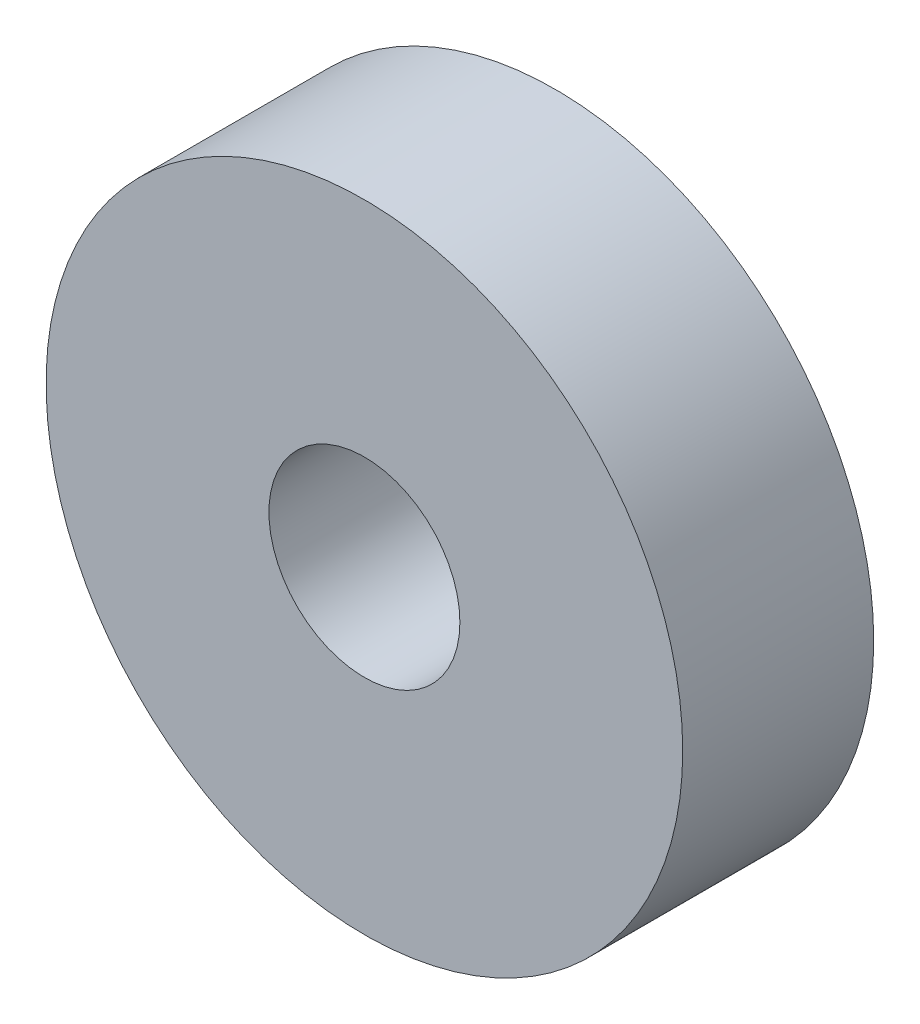
ISO-10303-21;
HEADER;
FILE_DESCRIPTION(('STEP AP214'),'2;1');
FILE_NAME('part.step','',(''),(''),'','','');
FILE_SCHEMA(('AUTOMOTIVE_DESIGN { 1 0 10303 214 1 1 1 1 }'));
ENDSEC;
DATA;
#1=APPLICATION_CONTEXT('core data for automotive mechanical design processes');
#2=APPLICATION_PROTOCOL_DEFINITION('international standard','automotive_design',2000,#1);
#3=PRODUCT_CONTEXT('',#1,'mechanical');
#4=PRODUCT('Part','Part','',(#3));
#5=PRODUCT_RELATED_PRODUCT_CATEGORY('part','',(#4));
#6=PRODUCT_DEFINITION_FORMATION('','',#4);
#7=PRODUCT_DEFINITION_CONTEXT('part definition',#1,'design');
#8=PRODUCT_DEFINITION('design','',#6,#7);
#9=PRODUCT_DEFINITION_SHAPE('','',#8);
#10=(LENGTH_UNIT() NAMED_UNIT(*) SI_UNIT(.MILLI.,.METRE.));
#11=(NAMED_UNIT(*) PLANE_ANGLE_UNIT() SI_UNIT($,.RADIAN.));
#12=(NAMED_UNIT(*) SI_UNIT($,.STERADIAN.) SOLID_ANGLE_UNIT());
#13=UNCERTAINTY_MEASURE_WITH_UNIT(LENGTH_MEASURE(1.E-05),#10,'distance_accuracy_value','');
#14=(GEOMETRIC_REPRESENTATION_CONTEXT(3) GLOBAL_UNCERTAINTY_ASSIGNED_CONTEXT((#13)) GLOBAL_UNIT_ASSIGNED_CONTEXT((#10,
#11,#12)) REPRESENTATION_CONTEXT('',''));
#15=CARTESIAN_POINT('',(0.,0.,0.));
#16=DIRECTION('',(0.,0.,1.));
#17=DIRECTION('',(1.,0.,0.));
#18=AXIS2_PLACEMENT_3D('',#15,#16,#17);
#19=CARTESIAN_POINT('',(0.,0.,6.));
#20=DIRECTION('',(0.,0.,1.));
#21=DIRECTION('',(1.,0.,0.));
#22=AXIS2_PLACEMENT_3D('',#19,#20,#21);
#23=PLANE('',#22);
#24=CARTESIAN_POINT('',(0.,0.,6.));
#25=DIRECTION('',(0.,0.,1.));
#26=DIRECTION('',(1.,0.,0.));
#27=AXIS2_PLACEMENT_3D('',#24,#25,#26);
#28=CIRCLE('',#27,10.);
#29=CARTESIAN_POINT('',(10.,0.,6.));
#30=VERTEX_POINT('',#29);
#31=EDGE_CURVE('E10',#30,#30,#28,.T.);
#32=ORIENTED_EDGE('',*,*,#31,.T.);
#33=EDGE_LOOP('',(#32));
#34=FACE_BOUND('',#33,.T.);
#35=CARTESIAN_POINT('',(0.,0.,6.));
#36=DIRECTION('',(0.,0.,1.));
#37=DIRECTION('',(1.,0.,0.));
#38=AXIS2_PLACEMENT_3D('',#35,#36,#37);
#39=CIRCLE('',#38,3.);
#40=CARTESIAN_POINT('',(3.,0.,6.));
#41=VERTEX_POINT('',#40);
#42=EDGE_CURVE('E49',#41,#41,#39,.T.);
#43=ORIENTED_EDGE('',*,*,#42,.F.);
#44=EDGE_LOOP('',(#43));
#45=FACE_BOUND('',#44,.T.);
#46=ADVANCED_FACE('F36',(#34,#45),#23,.T.);
#47=CARTESIAN_POINT('',(0.,0.,0.));
#48=DIRECTION('',(0.,0.,1.));
#49=DIRECTION('',(1.,0.,0.));
#50=AXIS2_PLACEMENT_3D('',#47,#48,#49);
#51=PLANE('',#50);
#52=CARTESIAN_POINT('',(0.,0.,0.));
#53=DIRECTION('',(0.,0.,1.));
#54=DIRECTION('',(1.,0.,0.));
#55=AXIS2_PLACEMENT_3D('',#52,#53,#54);
#56=CIRCLE('',#55,10.);
#57=CARTESIAN_POINT('',(10.,0.,0.));
#58=VERTEX_POINT('',#57);
#59=EDGE_CURVE('E40',#58,#58,#56,.T.);
#60=ORIENTED_EDGE('',*,*,#59,.F.);
#61=EDGE_LOOP('',(#60));
#62=FACE_BOUND('',#61,.T.);
#63=CARTESIAN_POINT('',(0.,0.,0.));
#64=DIRECTION('',(0.,0.,1.));
#65=DIRECTION('',(1.,0.,0.));
#66=AXIS2_PLACEMENT_3D('',#63,#64,#65);
#67=CIRCLE('',#66,3.);
#68=CARTESIAN_POINT('',(3.,0.,0.));
#69=VERTEX_POINT('',#68);
#70=EDGE_CURVE('E51',#69,#69,#67,.T.);
#71=ORIENTED_EDGE('',*,*,#70,.T.);
#72=EDGE_LOOP('',(#71));
#73=FACE_BOUND('',#72,.T.);
#74=ADVANCED_FACE('F63',(#62,#73),#51,.F.);
#75=CARTESIAN_POINT('',(0.,0.,6.));
#76=DIRECTION('',(0.,0.,-1.));
#77=DIRECTION('',(-1.,0.,0.));
#78=AXIS2_PLACEMENT_3D('',#75,#76,#77);
#79=CYLINDRICAL_SURFACE('',#78,10.);
#80=ORIENTED_EDGE('',*,*,#31,.F.);
#81=EDGE_LOOP('',(#80));
#82=FACE_BOUND('',#81,.T.);
#83=ORIENTED_EDGE('',*,*,#59,.T.);
#84=EDGE_LOOP('',(#83));
#85=FACE_BOUND('',#84,.T.);
#86=ADVANCED_FACE('F38',(#82,#85),#79,.T.);
#87=CARTESIAN_POINT('',(0.,0.,6.));
#88=DIRECTION('',(0.,0.,-1.));
#89=DIRECTION('',(-1.,0.,0.));
#90=AXIS2_PLACEMENT_3D('',#87,#88,#89);
#91=CYLINDRICAL_SURFACE('',#90,3.);
#92=ORIENTED_EDGE('',*,*,#42,.T.);
#93=EDGE_LOOP('',(#92));
#94=FACE_BOUND('',#93,.T.);
#95=ORIENTED_EDGE('',*,*,#70,.F.);
#96=EDGE_LOOP('',(#95));
#97=FACE_BOUND('',#96,.T.);
#98=ADVANCED_FACE('F59',(#94,#97),#91,.F.);
#99=CLOSED_SHELL('',(#46,#74,#86,#98));
#100=MANIFOLD_SOLID_BREP('B2',#99);
#101=ADVANCED_BREP_SHAPE_REPRESENTATION('',(#18,#100),#14);
#102=SHAPE_DEFINITION_REPRESENTATION(#9,#101);
ENDSEC;
END-ISO-10303-21;
